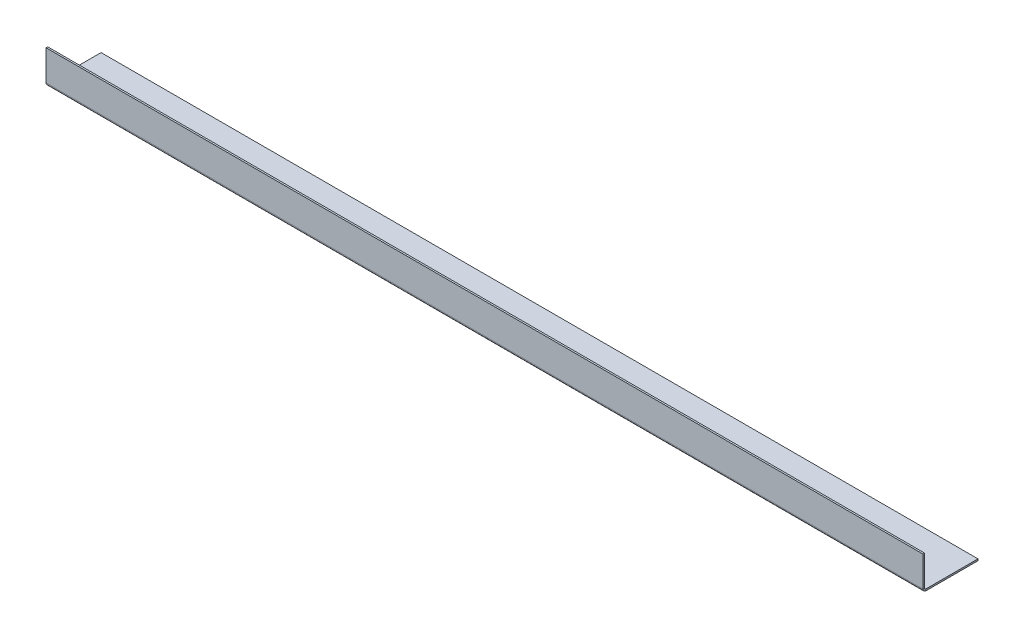
ISO-10303-21;
HEADER;
FILE_DESCRIPTION(('STEP AP214'),'2;1');
FILE_NAME('part.step','',(''),(''),'','','');
FILE_SCHEMA(('AUTOMOTIVE_DESIGN { 1 0 10303 214 1 1 1 1 }'));
ENDSEC;
DATA;
#1=APPLICATION_CONTEXT('core data for automotive mechanical design processes');
#2=APPLICATION_PROTOCOL_DEFINITION('international standard','automotive_design',2000,#1);
#3=PRODUCT_CONTEXT('',#1,'mechanical');
#4=PRODUCT('Part','Part','',(#3));
#5=PRODUCT_RELATED_PRODUCT_CATEGORY('part','',(#4));
#6=PRODUCT_DEFINITION_FORMATION('','',#4);
#7=PRODUCT_DEFINITION_CONTEXT('part definition',#1,'design');
#8=PRODUCT_DEFINITION('design','',#6,#7);
#9=PRODUCT_DEFINITION_SHAPE('','',#8);
#10=(LENGTH_UNIT() NAMED_UNIT(*) SI_UNIT(.MILLI.,.METRE.));
#11=(NAMED_UNIT(*) PLANE_ANGLE_UNIT() SI_UNIT($,.RADIAN.));
#12=(NAMED_UNIT(*) SI_UNIT($,.STERADIAN.) SOLID_ANGLE_UNIT());
#13=UNCERTAINTY_MEASURE_WITH_UNIT(LENGTH_MEASURE(1.E-05),#10,'distance_accuracy_value','');
#14=(GEOMETRIC_REPRESENTATION_CONTEXT(3) GLOBAL_UNCERTAINTY_ASSIGNED_CONTEXT((#13)) GLOBAL_UNIT_ASSIGNED_CONTEXT((#10,
#11,#12)) REPRESENTATION_CONTEXT('',''));
#15=CARTESIAN_POINT('',(0.,0.,0.));
#16=DIRECTION('',(0.,0.,1.));
#17=DIRECTION('',(1.,0.,0.));
#18=AXIS2_PLACEMENT_3D('',#15,#16,#17);
#19=CARTESIAN_POINT('',(0.,3.,93.5));
#20=DIRECTION('',(0.,-1.,0.));
#21=DIRECTION('',(1.,0.,0.));
#22=AXIS2_PLACEMENT_3D('',#19,#20,#21);
#23=PLANE('',#22);
#24=DIRECTION('',(-1.,0.,0.));
#25=VECTOR('',#24,1.);
#26=CARTESIAN_POINT('',(0.,3.,0.));
#27=LINE('',#26,#25);
#28=CARTESIAN_POINT('',(0.,3.,0.));
#29=VERTEX_POINT('',#28);
#30=CARTESIAN_POINT('',(-1576.,2.99999999999981,0.));
#31=VERTEX_POINT('',#30);
#32=EDGE_CURVE('E115',#29,#31,#27,.T.);
#33=ORIENTED_EDGE('',*,*,#32,.T.);
#34=DIRECTION('',(0.,0.,-1.));
#35=VECTOR('',#34,1.);
#36=CARTESIAN_POINT('',(-1576.,2.99999999999981,93.5));
#37=LINE('',#36,#35);
#38=CARTESIAN_POINT('',(-1576.,2.99999999999989,93.5));
#39=VERTEX_POINT('',#38);
#40=EDGE_CURVE('E13',#39,#31,#37,.T.);
#41=ORIENTED_EDGE('',*,*,#40,.F.);
#42=DIRECTION('',(-1.,0.,0.));
#43=VECTOR('',#42,1.);
#44=CARTESIAN_POINT('',(0.,3.,93.5));
#45=LINE('',#44,#43);
#46=CARTESIAN_POINT('',(0.,2.99999999999989,93.5));
#47=VERTEX_POINT('',#46);
#48=EDGE_CURVE('E116',#47,#39,#45,.T.);
#49=ORIENTED_EDGE('',*,*,#48,.F.);
#50=DIRECTION('',(0.,0.,-1.));
#51=VECTOR('',#50,1.);
#52=CARTESIAN_POINT('',(0.,3.,93.5));
#53=LINE('',#52,#51);
#54=EDGE_CURVE('E101',#47,#29,#53,.T.);
#55=ORIENTED_EDGE('',*,*,#54,.T.);
#56=EDGE_LOOP('',(#33,#41,#49,#55));
#57=FACE_BOUND('',#56,.T.);
#58=ADVANCED_FACE('F58',(#57),#23,.F.);
#59=CARTESIAN_POINT('',(-1576.,-1.93004335545623E-13,93.5));
#60=DIRECTION('',(-1.,0.,0.));
#61=DIRECTION('',(0.,0.,1.));
#62=AXIS2_PLACEMENT_3D('',#59,#60,#61);
#63=PLANE('',#62);
#64=DIRECTION('',(0.,1.,0.));
#65=VECTOR('',#64,1.);
#66=CARTESIAN_POINT('',(-1576.,-1.93004335545623E-13,0.));
#67=LINE('',#66,#65);
#68=CARTESIAN_POINT('',(-1576.,-1.93004335545623E-13,0.));
#69=VERTEX_POINT('',#68);
#70=EDGE_CURVE('E110',#69,#31,#67,.T.);
#71=ORIENTED_EDGE('',*,*,#70,.F.);
#72=DIRECTION('',(0.,0.,-1.));
#73=VECTOR('',#72,1.);
#74=CARTESIAN_POINT('',(-1576.,-1.93004335545623E-13,93.5));
#75=LINE('',#74,#73);
#76=CARTESIAN_POINT('',(-1576.,-1.93004335545623E-13,93.5));
#77=VERTEX_POINT('',#76);
#78=EDGE_CURVE('E66',#77,#69,#75,.T.);
#79=ORIENTED_EDGE('',*,*,#78,.F.);
#80=DIRECTION('',(0.,1.,0.));
#81=VECTOR('',#80,1.);
#82=CARTESIAN_POINT('',(-1576.,-1.93004335545623E-13,93.5));
#83=LINE('',#82,#81);
#84=EDGE_CURVE('E119',#77,#39,#83,.T.);
#85=ORIENTED_EDGE('',*,*,#84,.T.);
#86=ORIENTED_EDGE('',*,*,#40,.T.);
#87=EDGE_LOOP('',(#71,#79,#85,#86));
#88=FACE_BOUND('',#87,.T.);
#89=ADVANCED_FACE('F131',(#88),#63,.T.);
#90=CARTESIAN_POINT('',(0.,0.,93.5));
#91=DIRECTION('',(0.,-1.,0.));
#92=DIRECTION('',(1.,0.,0.));
#93=AXIS2_PLACEMENT_3D('',#90,#91,#92);
#94=PLANE('',#93);
#95=DIRECTION('',(-1.,0.,0.));
#96=VECTOR('',#95,1.);
#97=CARTESIAN_POINT('',(0.,0.,0.));
#98=LINE('',#97,#96);
#99=CARTESIAN_POINT('',(0.,0.,0.));
#100=VERTEX_POINT('',#99);
#101=EDGE_CURVE('E104',#100,#69,#98,.T.);
#102=ORIENTED_EDGE('',*,*,#101,.F.);
#103=DIRECTION('',(0.,0.,-1.));
#104=VECTOR('',#103,1.);
#105=CARTESIAN_POINT('',(0.,0.,93.5));
#106=LINE('',#105,#104);
#107=CARTESIAN_POINT('',(0.,-1.0842021724855E-13,93.5));
#108=VERTEX_POINT('',#107);
#109=EDGE_CURVE('E91',#108,#100,#106,.T.);
#110=ORIENTED_EDGE('',*,*,#109,.F.);
#111=DIRECTION('',(-1.,0.,0.));
#112=VECTOR('',#111,1.);
#113=CARTESIAN_POINT('',(0.,0.,93.5));
#114=LINE('',#113,#112);
#115=EDGE_CURVE('E125',#108,#77,#114,.T.);
#116=ORIENTED_EDGE('',*,*,#115,.T.);
#117=ORIENTED_EDGE('',*,*,#78,.T.);
#118=EDGE_LOOP('',(#102,#110,#116,#117));
#119=FACE_BOUND('',#118,.T.);
#120=ADVANCED_FACE('F105',(#119),#94,.T.);
#121=CARTESIAN_POINT('',(0.,3.,93.5));
#122=DIRECTION('',(1.,0.,0.));
#123=DIRECTION('',(0.,1.,0.));
#124=AXIS2_PLACEMENT_3D('',#121,#122,#123);
#125=PLANE('',#124);
#126=DIRECTION('',(0.,-1.,0.));
#127=VECTOR('',#126,1.);
#128=CARTESIAN_POINT('',(0.,3.,0.));
#129=LINE('',#128,#127);
#130=EDGE_CURVE('E96',#29,#100,#129,.T.);
#131=ORIENTED_EDGE('',*,*,#130,.F.);
#132=ORIENTED_EDGE('',*,*,#54,.F.);
#133=DIRECTION('',(0.,-1.,0.));
#134=VECTOR('',#133,1.);
#135=CARTESIAN_POINT('',(0.,3.,93.5));
#136=LINE('',#135,#134);
#137=EDGE_CURVE('E98',#47,#108,#136,.T.);
#138=ORIENTED_EDGE('',*,*,#137,.T.);
#139=ORIENTED_EDGE('',*,*,#109,.T.);
#140=EDGE_LOOP('',(#131,#132,#138,#139));
#141=FACE_BOUND('',#140,.T.);
#142=ADVANCED_FACE('F93',(#141),#125,.T.);
#143=CARTESIAN_POINT('',(0.,0.,0.));
#144=DIRECTION('',(0.,0.,-1.));
#145=DIRECTION('',(-1.,0.,0.));
#146=AXIS2_PLACEMENT_3D('',#143,#144,#145);
#147=PLANE('',#146);
#148=ORIENTED_EDGE('',*,*,#32,.F.);
#149=ORIENTED_EDGE('',*,*,#130,.T.);
#150=ORIENTED_EDGE('',*,*,#101,.T.);
#151=ORIENTED_EDGE('',*,*,#70,.T.);
#152=EDGE_LOOP('',(#148,#149,#150,#151));
#153=FACE_BOUND('',#152,.T.);
#154=ADVANCED_FACE('F113',(#153),#147,.T.);
#155=CARTESIAN_POINT('',(-1576.,5.49999999999988,93.5));
#156=DIRECTION('',(-1.,0.,0.));
#157=DIRECTION('',(0.,0.,1.));
#158=AXIS2_PLACEMENT_3D('',#155,#156,#157);
#159=PLANE('',#158);
#160=DIRECTION('',(0.,0.,-1.));
#161=VECTOR('',#160,1.);
#162=CARTESIAN_POINT('',(-1576.,5.4999999999998,99.));
#163=LINE('',#162,#161);
#164=CARTESIAN_POINT('',(-1576.,5.49999999999988,96.));
#165=VERTEX_POINT('',#164);
#166=CARTESIAN_POINT('',(-1576.,5.49999999999988,99.));
#167=VERTEX_POINT('',#166);
#168=EDGE_CURVE('E226',#165,#167,#163,.F.);
#169=ORIENTED_EDGE('',*,*,#168,.F.);
#170=CARTESIAN_POINT('',(-1576.,5.49999999999988,93.5));
#171=DIRECTION('',(1.,0.,0.));
#172=DIRECTION('',(0.,0.,-1.));
#173=AXIS2_PLACEMENT_3D('',#170,#171,#172);
#174=CIRCLE('',#173,2.49999999999999);
#175=EDGE_CURVE('E233',#39,#165,#174,.F.);
#176=ORIENTED_EDGE('',*,*,#175,.F.);
#177=ORIENTED_EDGE('',*,*,#84,.F.);
#178=CARTESIAN_POINT('',(-1576.,5.49999999999988,93.5));
#179=DIRECTION('',(1.,0.,0.));
#180=DIRECTION('',(0.,0.,-1.));
#181=AXIS2_PLACEMENT_3D('',#178,#179,#180);
#182=CIRCLE('',#181,5.49999999999999);
#183=EDGE_CURVE('E73',#77,#167,#182,.F.);
#184=ORIENTED_EDGE('',*,*,#183,.T.);
#185=EDGE_LOOP('',(#169,#176,#177,#184));
#186=FACE_BOUND('',#185,.T.);
#187=ADVANCED_FACE('F148',(#186),#159,.T.);
#188=CARTESIAN_POINT('',(0.,5.49999999999988,93.5));
#189=DIRECTION('',(-1.,0.,0.));
#190=DIRECTION('',(0.,0.,1.));
#191=AXIS2_PLACEMENT_3D('',#188,#189,#190);
#192=PLANE('',#191);
#193=CARTESIAN_POINT('',(0.,5.49999999999988,93.5));
#194=DIRECTION('',(1.,0.,0.));
#195=DIRECTION('',(0.,0.,-1.));
#196=AXIS2_PLACEMENT_3D('',#193,#194,#195);
#197=CIRCLE('',#196,2.49999999999999);
#198=CARTESIAN_POINT('',(0.,5.49999999999988,96.));
#199=VERTEX_POINT('',#198);
#200=EDGE_CURVE('E236',#199,#47,#197,.T.);
#201=ORIENTED_EDGE('',*,*,#200,.F.);
#202=DIRECTION('',(0.,0.,-1.));
#203=VECTOR('',#202,1.);
#204=CARTESIAN_POINT('',(0.,5.49999999999996,96.));
#205=LINE('',#204,#203);
#206=CARTESIAN_POINT('',(0.,5.49999999999996,99.));
#207=VERTEX_POINT('',#206);
#208=EDGE_CURVE('E201',#199,#207,#205,.F.);
#209=ORIENTED_EDGE('',*,*,#208,.T.);
#210=CARTESIAN_POINT('',(0.,5.49999999999988,93.5));
#211=DIRECTION('',(1.,0.,0.));
#212=DIRECTION('',(0.,0.,-1.));
#213=AXIS2_PLACEMENT_3D('',#210,#211,#212);
#214=CIRCLE('',#213,5.49999999999999);
#215=EDGE_CURVE('E230',#207,#108,#214,.T.);
#216=ORIENTED_EDGE('',*,*,#215,.T.);
#217=ORIENTED_EDGE('',*,*,#137,.F.);
#218=EDGE_LOOP('',(#201,#209,#216,#217));
#219=FACE_BOUND('',#218,.T.);
#220=ADVANCED_FACE('F149',(#219),#192,.F.);
#221=CARTESIAN_POINT('',(0.,5.49999999999988,93.5));
#222=DIRECTION('',(1.,0.,0.));
#223=DIRECTION('',(0.,0.,1.));
#224=AXIS2_PLACEMENT_3D('',#221,#222,#223);
#225=CYLINDRICAL_SURFACE('',#224,5.49999999999999);
#226=ORIENTED_EDGE('',*,*,#115,.F.);
#227=ORIENTED_EDGE('',*,*,#215,.F.);
#228=DIRECTION('',(1.,0.,0.));
#229=VECTOR('',#228,1.);
#230=CARTESIAN_POINT('',(-1576.,5.4999999999998,99.));
#231=LINE('',#230,#229);
#232=EDGE_CURVE('E188',#207,#167,#231,.F.);
#233=ORIENTED_EDGE('',*,*,#232,.T.);
#234=ORIENTED_EDGE('',*,*,#183,.F.);
#235=EDGE_LOOP('',(#226,#227,#233,#234));
#236=FACE_BOUND('',#235,.T.);
#237=ADVANCED_FACE('F152',(#236),#225,.T.);
#238=CARTESIAN_POINT('',(0.,5.49999999999988,93.5));
#239=DIRECTION('',(1.,0.,0.));
#240=DIRECTION('',(0.,0.,1.));
#241=AXIS2_PLACEMENT_3D('',#238,#239,#240);
#242=CYLINDRICAL_SURFACE('',#241,2.49999999999999);
#243=ORIENTED_EDGE('',*,*,#48,.T.);
#244=ORIENTED_EDGE('',*,*,#175,.T.);
#245=DIRECTION('',(1.,0.,0.));
#246=VECTOR('',#245,1.);
#247=CARTESIAN_POINT('',(-1576.,5.4999999999998,96.));
#248=LINE('',#247,#246);
#249=EDGE_CURVE('E223',#165,#199,#248,.T.);
#250=ORIENTED_EDGE('',*,*,#249,.T.);
#251=ORIENTED_EDGE('',*,*,#200,.T.);
#252=EDGE_LOOP('',(#243,#244,#250,#251));
#253=FACE_BOUND('',#252,.T.);
#254=ADVANCED_FACE('F157',(#253),#242,.F.);
#255=CARTESIAN_POINT('',(0.,60.,99.));
#256=DIRECTION('',(-1.,0.,0.));
#257=DIRECTION('',(0.,-1.,0.));
#258=AXIS2_PLACEMENT_3D('',#255,#256,#257);
#259=PLANE('',#258);
#260=ORIENTED_EDGE('',*,*,#208,.F.);
#261=DIRECTION('',(0.,-1.,0.));
#262=VECTOR('',#261,1.);
#263=CARTESIAN_POINT('',(0.,60.,96.));
#264=LINE('',#263,#262);
#265=CARTESIAN_POINT('',(0.,60.,96.));
#266=VERTEX_POINT('',#265);
#267=EDGE_CURVE('E200',#199,#266,#264,.F.);
#268=ORIENTED_EDGE('',*,*,#267,.T.);
#269=DIRECTION('',(0.,0.,-1.));
#270=VECTOR('',#269,1.);
#271=CARTESIAN_POINT('',(0.,60.,99.));
#272=LINE('',#271,#270);
#273=CARTESIAN_POINT('',(0.,60.,99.));
#274=VERTEX_POINT('',#273);
#275=EDGE_CURVE('E208',#274,#266,#272,.T.);
#276=ORIENTED_EDGE('',*,*,#275,.F.);
#277=DIRECTION('',(0.,1.,0.));
#278=VECTOR('',#277,1.);
#279=CARTESIAN_POINT('',(0.,0.,99.));
#280=LINE('',#279,#278);
#281=EDGE_CURVE('E192',#207,#274,#280,.T.);
#282=ORIENTED_EDGE('',*,*,#281,.F.);
#283=EDGE_LOOP('',(#260,#268,#276,#282));
#284=FACE_BOUND('',#283,.T.);
#285=ADVANCED_FACE('F160',(#284),#259,.F.);
#286=CARTESIAN_POINT('',(-1576.,2.99999999999981,99.));
#287=DIRECTION('',(1.,0.,0.));
#288=DIRECTION('',(0.,0.,-1.));
#289=AXIS2_PLACEMENT_3D('',#286,#287,#288);
#290=PLANE('',#289);
#291=ORIENTED_EDGE('',*,*,#168,.T.);
#292=DIRECTION('',(0.,-1.,0.));
#293=VECTOR('',#292,1.);
#294=CARTESIAN_POINT('',(-1576.,0.,99.));
#295=LINE('',#294,#293);
#296=CARTESIAN_POINT('',(-1576.,60.,99.));
#297=VERTEX_POINT('',#296);
#298=EDGE_CURVE('E196',#297,#167,#295,.T.);
#299=ORIENTED_EDGE('',*,*,#298,.F.);
#300=DIRECTION('',(0.,0.,-1.));
#301=VECTOR('',#300,1.);
#302=CARTESIAN_POINT('',(-1576.,60.,99.));
#303=LINE('',#302,#301);
#304=CARTESIAN_POINT('',(-1576.,60.,96.));
#305=VERTEX_POINT('',#304);
#306=EDGE_CURVE('E240',#297,#305,#303,.T.);
#307=ORIENTED_EDGE('',*,*,#306,.T.);
#308=DIRECTION('',(0.,1.,0.));
#309=VECTOR('',#308,1.);
#310=CARTESIAN_POINT('',(-1576.,2.99999999999981,96.));
#311=LINE('',#310,#309);
#312=EDGE_CURVE('E211',#305,#165,#311,.F.);
#313=ORIENTED_EDGE('',*,*,#312,.T.);
#314=EDGE_LOOP('',(#291,#299,#307,#313));
#315=FACE_BOUND('',#314,.T.);
#316=ADVANCED_FACE('F166',(#315),#290,.F.);
#317=CARTESIAN_POINT('',(0.,0.,99.));
#318=DIRECTION('',(0.,0.,-1.));
#319=DIRECTION('',(-1.,0.,0.));
#320=AXIS2_PLACEMENT_3D('',#317,#318,#319);
#321=PLANE('',#320);
#322=ORIENTED_EDGE('',*,*,#232,.F.);
#323=ORIENTED_EDGE('',*,*,#281,.T.);
#324=DIRECTION('',(-1.,0.,0.));
#325=VECTOR('',#324,1.);
#326=CARTESIAN_POINT('',(0.,60.,99.));
#327=LINE('',#326,#325);
#328=EDGE_CURVE('E210',#274,#297,#327,.T.);
#329=ORIENTED_EDGE('',*,*,#328,.T.);
#330=ORIENTED_EDGE('',*,*,#298,.T.);
#331=EDGE_LOOP('',(#322,#323,#329,#330));
#332=FACE_BOUND('',#331,.T.);
#333=ADVANCED_FACE('F175',(#332),#321,.F.);
#334=CARTESIAN_POINT('',(0.,0.,96.));
#335=DIRECTION('',(0.,0.,-1.));
#336=DIRECTION('',(-1.,0.,0.));
#337=AXIS2_PLACEMENT_3D('',#334,#335,#336);
#338=PLANE('',#337);
#339=ORIENTED_EDGE('',*,*,#267,.F.);
#340=ORIENTED_EDGE('',*,*,#249,.F.);
#341=ORIENTED_EDGE('',*,*,#312,.F.);
#342=DIRECTION('',(1.,0.,0.));
#343=VECTOR('',#342,1.);
#344=CARTESIAN_POINT('',(-1576.,60.,96.));
#345=LINE('',#344,#343);
#346=EDGE_CURVE('E215',#266,#305,#345,.F.);
#347=ORIENTED_EDGE('',*,*,#346,.F.);
#348=EDGE_LOOP('',(#339,#340,#341,#347));
#349=FACE_BOUND('',#348,.T.);
#350=ADVANCED_FACE('F171',(#349),#338,.T.);
#351=CARTESIAN_POINT('',(-1576.,60.,99.));
#352=DIRECTION('',(0.,-1.,0.));
#353=DIRECTION('',(0.,0.,-1.));
#354=AXIS2_PLACEMENT_3D('',#351,#352,#353);
#355=PLANE('',#354);
#356=ORIENTED_EDGE('',*,*,#346,.T.);
#357=ORIENTED_EDGE('',*,*,#306,.F.);
#358=ORIENTED_EDGE('',*,*,#328,.F.);
#359=ORIENTED_EDGE('',*,*,#275,.T.);
#360=EDGE_LOOP('',(#356,#357,#358,#359));
#361=FACE_BOUND('',#360,.T.);
#362=ADVANCED_FACE('F168',(#361),#355,.F.);
#363=CLOSED_SHELL('',(#58,#89,#120,#142,#154,#187,#220,#237,#254,#285,#316,#333,#350,#362));
#364=MANIFOLD_SOLID_BREP('B2',#363);
#365=ADVANCED_BREP_SHAPE_REPRESENTATION('',(#18,#364),#14);
#366=SHAPE_DEFINITION_REPRESENTATION(#9,#365);
ENDSEC;
END-ISO-10303-21;
